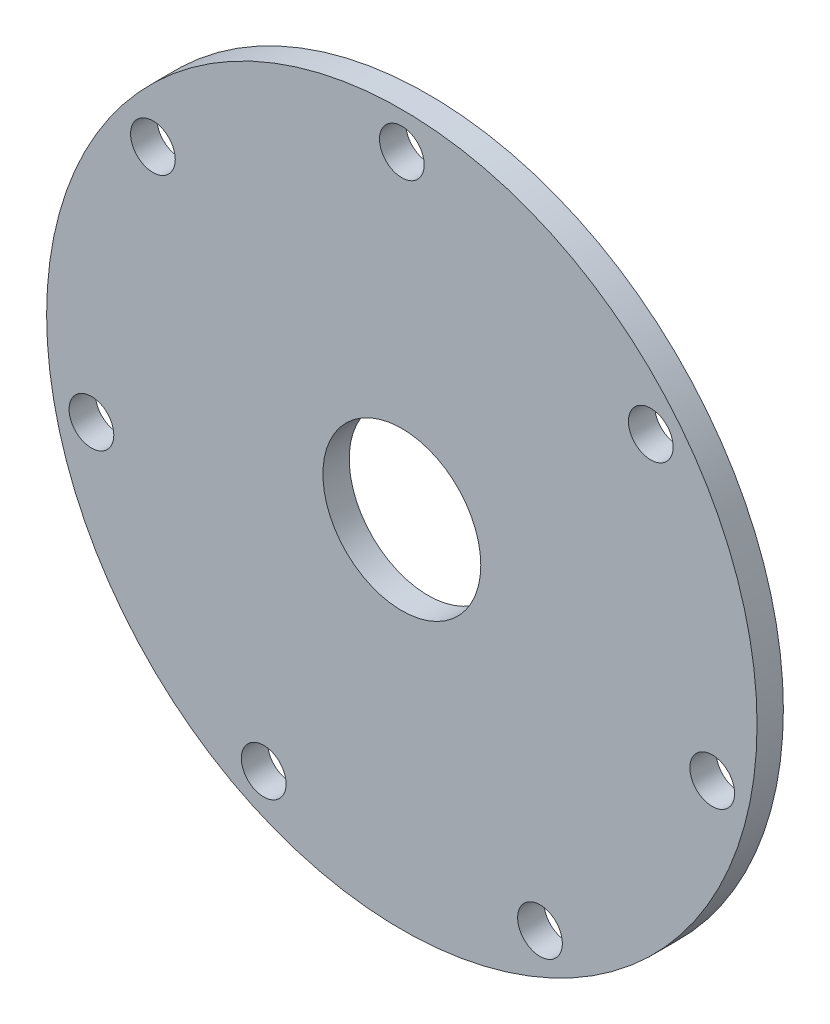
ISO-10303-21;
HEADER;
FILE_DESCRIPTION(('STEP AP214'),'2;1');
FILE_NAME('part.step','',(''),(''),'','','');
FILE_SCHEMA(('AUTOMOTIVE_DESIGN { 1 0 10303 214 1 1 1 1 }'));
ENDSEC;
DATA;
#1=APPLICATION_CONTEXT('core data for automotive mechanical design processes');
#2=APPLICATION_PROTOCOL_DEFINITION('international standard','automotive_design',2000,#1);
#3=PRODUCT_CONTEXT('',#1,'mechanical');
#4=PRODUCT('Part','Part','',(#3));
#5=PRODUCT_RELATED_PRODUCT_CATEGORY('part','',(#4));
#6=PRODUCT_DEFINITION_FORMATION('','',#4);
#7=PRODUCT_DEFINITION_CONTEXT('part definition',#1,'design');
#8=PRODUCT_DEFINITION('design','',#6,#7);
#9=PRODUCT_DEFINITION_SHAPE('','',#8);
#10=(LENGTH_UNIT() NAMED_UNIT(*) SI_UNIT(.MILLI.,.METRE.));
#11=(NAMED_UNIT(*) PLANE_ANGLE_UNIT() SI_UNIT($,.RADIAN.));
#12=(NAMED_UNIT(*) SI_UNIT($,.STERADIAN.) SOLID_ANGLE_UNIT());
#13=UNCERTAINTY_MEASURE_WITH_UNIT(LENGTH_MEASURE(1.E-05),#10,'distance_accuracy_value','');
#14=(GEOMETRIC_REPRESENTATION_CONTEXT(3) GLOBAL_UNCERTAINTY_ASSIGNED_CONTEXT((#13)) GLOBAL_UNIT_ASSIGNED_CONTEXT((#10,
#11,#12)) REPRESENTATION_CONTEXT('',''));
#15=CARTESIAN_POINT('',(0.,0.,0.));
#16=DIRECTION('',(0.,0.,1.));
#17=DIRECTION('',(1.,0.,0.));
#18=AXIS2_PLACEMENT_3D('',#15,#16,#17);
#19=CARTESIAN_POINT('',(0.,0.,5.));
#20=DIRECTION('',(0.,0.,1.));
#21=DIRECTION('',(1.,0.,0.));
#22=AXIS2_PLACEMENT_3D('',#19,#20,#21);
#23=PLANE('',#22);
#24=CARTESIAN_POINT('',(-47.3008046893158,37.7211330124534,5.));
#25=DIRECTION('',(0.,0.,1.));
#26=DIRECTION('',(1.,0.,0.));
#27=AXIS2_PLACEMENT_3D('',#24,#25,#26);
#28=CIRCLE('',#27,4.25);
#29=CARTESIAN_POINT('',(-43.0508046893158,37.7211330124534,5.));
#30=VERTEX_POINT('',#29);
#31=EDGE_CURVE('E77',#30,#30,#28,.T.);
#32=ORIENTED_EDGE('',*,*,#31,.F.);
#33=EDGE_LOOP('',(#32));
#34=FACE_BOUND('',#33,.T.);
#35=CARTESIAN_POINT('',(-26.2499662166123,-54.5086165080964,5.));
#36=DIRECTION('',(0.,0.,1.));
#37=DIRECTION('',(1.,0.,0.));
#38=AXIS2_PLACEMENT_3D('',#35,#36,#37);
#39=CIRCLE('',#38,4.25000000000001);
#40=CARTESIAN_POINT('',(-21.9999662166122,-54.5086165080964,5.));
#41=VERTEX_POINT('',#40);
#42=EDGE_CURVE('E65',#41,#41,#39,.T.);
#43=ORIENTED_EDGE('',*,*,#42,.F.);
#44=EDGE_LOOP('',(#43));
#45=FACE_BOUND('',#44,.T.);
#46=CARTESIAN_POINT('',(58.9831386870003,-13.462516504357,5.));
#47=DIRECTION('',(0.,0.,1.));
#48=DIRECTION('',(1.,0.,0.));
#49=AXIS2_PLACEMENT_3D('',#46,#47,#48);
#50=CIRCLE('',#49,4.25000000000001);
#51=CARTESIAN_POINT('',(63.2331386870003,-13.462516504357,5.));
#52=VERTEX_POINT('',#51);
#53=EDGE_CURVE('E53',#52,#52,#50,.T.);
#54=ORIENTED_EDGE('',*,*,#53,.F.);
#55=EDGE_LOOP('',(#54));
#56=FACE_BOUND('',#55,.T.);
#57=CARTESIAN_POINT('',(0.,60.5,5.));
#58=DIRECTION('',(0.,0.,1.));
#59=DIRECTION('',(1.,0.,0.));
#60=AXIS2_PLACEMENT_3D('',#57,#58,#59);
#61=CIRCLE('',#60,4.25);
#62=CARTESIAN_POINT('',(4.25,60.5,5.));
#63=VERTEX_POINT('',#62);
#64=EDGE_CURVE('E42',#63,#63,#61,.T.);
#65=ORIENTED_EDGE('',*,*,#64,.F.);
#66=EDGE_LOOP('',(#65));
#67=FACE_BOUND('',#66,.T.);
#68=CARTESIAN_POINT('',(0.,0.,5.));
#69=DIRECTION('',(0.,0.,1.));
#70=DIRECTION('',(1.,0.,0.));
#71=AXIS2_PLACEMENT_3D('',#68,#69,#70);
#72=CIRCLE('',#71,67.5);
#73=CARTESIAN_POINT('',(67.5,0.,5.));
#74=VERTEX_POINT('',#73);
#75=EDGE_CURVE('E10',#74,#74,#72,.T.);
#76=ORIENTED_EDGE('',*,*,#75,.T.);
#77=EDGE_LOOP('',(#76));
#78=FACE_BOUND('',#77,.T.);
#79=CARTESIAN_POINT('',(47.3008046893158,37.7211330124534,5.));
#80=DIRECTION('',(0.,0.,1.));
#81=DIRECTION('',(1.,0.,0.));
#82=AXIS2_PLACEMENT_3D('',#79,#80,#81);
#83=CIRCLE('',#82,4.25);
#84=CARTESIAN_POINT('',(51.5508046893158,37.7211330124534,5.));
#85=VERTEX_POINT('',#84);
#86=EDGE_CURVE('E47',#85,#85,#83,.T.);
#87=ORIENTED_EDGE('',*,*,#86,.F.);
#88=EDGE_LOOP('',(#87));
#89=FACE_BOUND('',#88,.T.);
#90=CARTESIAN_POINT('',(26.2499662166123,-54.5086165080964,5.));
#91=DIRECTION('',(0.,0.,1.));
#92=DIRECTION('',(1.,0.,0.));
#93=AXIS2_PLACEMENT_3D('',#90,#91,#92);
#94=CIRCLE('',#93,4.25000000000001);
#95=CARTESIAN_POINT('',(30.4999662166123,-54.5086165080964,5.));
#96=VERTEX_POINT('',#95);
#97=EDGE_CURVE('E59',#96,#96,#94,.T.);
#98=ORIENTED_EDGE('',*,*,#97,.F.);
#99=EDGE_LOOP('',(#98));
#100=FACE_BOUND('',#99,.T.);
#101=CARTESIAN_POINT('',(-58.9831386870003,-13.462516504357,5.));
#102=DIRECTION('',(0.,0.,1.));
#103=DIRECTION('',(1.,0.,0.));
#104=AXIS2_PLACEMENT_3D('',#101,#102,#103);
#105=CIRCLE('',#104,4.25000000000001);
#106=CARTESIAN_POINT('',(-54.7331386870003,-13.462516504357,5.));
#107=VERTEX_POINT('',#106);
#108=EDGE_CURVE('E71',#107,#107,#105,.T.);
#109=ORIENTED_EDGE('',*,*,#108,.F.);
#110=EDGE_LOOP('',(#109));
#111=FACE_BOUND('',#110,.T.);
#112=CARTESIAN_POINT('',(0.,0.,5.));
#113=DIRECTION('',(0.,0.,1.));
#114=DIRECTION('',(1.,0.,0.));
#115=AXIS2_PLACEMENT_3D('',#112,#113,#114);
#116=CIRCLE('',#115,15.);
#117=CARTESIAN_POINT('',(15.,0.,5.));
#118=VERTEX_POINT('',#117);
#119=EDGE_CURVE('E83',#118,#118,#116,.T.);
#120=ORIENTED_EDGE('',*,*,#119,.F.);
#121=EDGE_LOOP('',(#120));
#122=FACE_BOUND('',#121,.T.);
#123=ADVANCED_FACE('F31',(#34,#45,#56,#67,#78,#89,#100,#111,#122),#23,.T.);
#124=CARTESIAN_POINT('',(0.,0.,0.));
#125=DIRECTION('',(0.,0.,1.));
#126=DIRECTION('',(1.,0.,0.));
#127=AXIS2_PLACEMENT_3D('',#124,#125,#126);
#128=PLANE('',#127);
#129=CARTESIAN_POINT('',(0.,0.,0.));
#130=DIRECTION('',(0.,0.,1.));
#131=DIRECTION('',(1.,0.,0.));
#132=AXIS2_PLACEMENT_3D('',#129,#130,#131);
#133=CIRCLE('',#132,67.5);
#134=CARTESIAN_POINT('',(67.5,0.,0.));
#135=VERTEX_POINT('',#134);
#136=EDGE_CURVE('E35',#135,#135,#133,.T.);
#137=ORIENTED_EDGE('',*,*,#136,.F.);
#138=EDGE_LOOP('',(#137));
#139=FACE_BOUND('',#138,.T.);
#140=CARTESIAN_POINT('',(0.,60.5,0.));
#141=DIRECTION('',(0.,0.,1.));
#142=DIRECTION('',(1.,0.,0.));
#143=AXIS2_PLACEMENT_3D('',#140,#141,#142);
#144=CIRCLE('',#143,4.25);
#145=CARTESIAN_POINT('',(4.25,60.5,0.));
#146=VERTEX_POINT('',#145);
#147=EDGE_CURVE('E44',#146,#146,#144,.T.);
#148=ORIENTED_EDGE('',*,*,#147,.T.);
#149=EDGE_LOOP('',(#148));
#150=FACE_BOUND('',#149,.T.);
#151=CARTESIAN_POINT('',(47.3008046893158,37.7211330124534,0.));
#152=DIRECTION('',(0.,0.,1.));
#153=DIRECTION('',(1.,0.,0.));
#154=AXIS2_PLACEMENT_3D('',#151,#152,#153);
#155=CIRCLE('',#154,4.25);
#156=CARTESIAN_POINT('',(51.5508046893158,37.7211330124534,0.));
#157=VERTEX_POINT('',#156);
#158=EDGE_CURVE('E50',#157,#157,#155,.T.);
#159=ORIENTED_EDGE('',*,*,#158,.T.);
#160=EDGE_LOOP('',(#159));
#161=FACE_BOUND('',#160,.T.);
#162=CARTESIAN_POINT('',(58.9831386870003,-13.462516504357,0.));
#163=DIRECTION('',(0.,0.,1.));
#164=DIRECTION('',(1.,0.,0.));
#165=AXIS2_PLACEMENT_3D('',#162,#163,#164);
#166=CIRCLE('',#165,4.25000000000001);
#167=CARTESIAN_POINT('',(63.2331386870003,-13.462516504357,0.));
#168=VERTEX_POINT('',#167);
#169=EDGE_CURVE('E56',#168,#168,#166,.T.);
#170=ORIENTED_EDGE('',*,*,#169,.T.);
#171=EDGE_LOOP('',(#170));
#172=FACE_BOUND('',#171,.T.);
#173=CARTESIAN_POINT('',(26.2499662166123,-54.5086165080964,0.));
#174=DIRECTION('',(0.,0.,1.));
#175=DIRECTION('',(1.,0.,0.));
#176=AXIS2_PLACEMENT_3D('',#173,#174,#175);
#177=CIRCLE('',#176,4.25000000000001);
#178=CARTESIAN_POINT('',(30.4999662166123,-54.5086165080964,0.));
#179=VERTEX_POINT('',#178);
#180=EDGE_CURVE('E62',#179,#179,#177,.T.);
#181=ORIENTED_EDGE('',*,*,#180,.T.);
#182=EDGE_LOOP('',(#181));
#183=FACE_BOUND('',#182,.T.);
#184=CARTESIAN_POINT('',(-26.2499662166123,-54.5086165080964,0.));
#185=DIRECTION('',(0.,0.,1.));
#186=DIRECTION('',(1.,0.,0.));
#187=AXIS2_PLACEMENT_3D('',#184,#185,#186);
#188=CIRCLE('',#187,4.25000000000001);
#189=CARTESIAN_POINT('',(-21.9999662166122,-54.5086165080964,0.));
#190=VERTEX_POINT('',#189);
#191=EDGE_CURVE('E68',#190,#190,#188,.T.);
#192=ORIENTED_EDGE('',*,*,#191,.T.);
#193=EDGE_LOOP('',(#192));
#194=FACE_BOUND('',#193,.T.);
#195=CARTESIAN_POINT('',(-58.9831386870003,-13.462516504357,0.));
#196=DIRECTION('',(0.,0.,1.));
#197=DIRECTION('',(1.,0.,0.));
#198=AXIS2_PLACEMENT_3D('',#195,#196,#197);
#199=CIRCLE('',#198,4.25000000000001);
#200=CARTESIAN_POINT('',(-54.7331386870003,-13.462516504357,0.));
#201=VERTEX_POINT('',#200);
#202=EDGE_CURVE('E74',#201,#201,#199,.T.);
#203=ORIENTED_EDGE('',*,*,#202,.T.);
#204=EDGE_LOOP('',(#203));
#205=FACE_BOUND('',#204,.T.);
#206=CARTESIAN_POINT('',(-47.3008046893158,37.7211330124534,0.));
#207=DIRECTION('',(0.,0.,1.));
#208=DIRECTION('',(1.,0.,0.));
#209=AXIS2_PLACEMENT_3D('',#206,#207,#208);
#210=CIRCLE('',#209,4.25);
#211=CARTESIAN_POINT('',(-43.0508046893158,37.7211330124534,0.));
#212=VERTEX_POINT('',#211);
#213=EDGE_CURVE('E80',#212,#212,#210,.T.);
#214=ORIENTED_EDGE('',*,*,#213,.T.);
#215=EDGE_LOOP('',(#214));
#216=FACE_BOUND('',#215,.T.);
#217=CARTESIAN_POINT('',(0.,0.,0.));
#218=DIRECTION('',(0.,0.,1.));
#219=DIRECTION('',(1.,0.,0.));
#220=AXIS2_PLACEMENT_3D('',#217,#218,#219);
#221=CIRCLE('',#220,15.);
#222=CARTESIAN_POINT('',(15.,0.,0.));
#223=VERTEX_POINT('',#222);
#224=EDGE_CURVE('E86',#223,#223,#221,.T.);
#225=ORIENTED_EDGE('',*,*,#224,.T.);
#226=EDGE_LOOP('',(#225));
#227=FACE_BOUND('',#226,.T.);
#228=ADVANCED_FACE('F96',(#139,#150,#161,#172,#183,#194,#205,#216,#227),#128,.F.);
#229=CARTESIAN_POINT('',(0.,0.,5.));
#230=DIRECTION('',(0.,0.,-1.));
#231=DIRECTION('',(-1.,0.,0.));
#232=AXIS2_PLACEMENT_3D('',#229,#230,#231);
#233=CYLINDRICAL_SURFACE('',#232,67.5);
#234=ORIENTED_EDGE('',*,*,#75,.F.);
#235=EDGE_LOOP('',(#234));
#236=FACE_BOUND('',#235,.T.);
#237=ORIENTED_EDGE('',*,*,#136,.T.);
#238=EDGE_LOOP('',(#237));
#239=FACE_BOUND('',#238,.T.);
#240=ADVANCED_FACE('F33',(#236,#239),#233,.T.);
#241=CARTESIAN_POINT('',(0.,60.5,5.));
#242=DIRECTION('',(0.,0.,-1.));
#243=DIRECTION('',(-1.,0.,0.));
#244=AXIS2_PLACEMENT_3D('',#241,#242,#243);
#245=CYLINDRICAL_SURFACE('',#244,4.25);
#246=ORIENTED_EDGE('',*,*,#64,.T.);
#247=EDGE_LOOP('',(#246));
#248=FACE_BOUND('',#247,.T.);
#249=ORIENTED_EDGE('',*,*,#147,.F.);
#250=EDGE_LOOP('',(#249));
#251=FACE_BOUND('',#250,.T.);
#252=ADVANCED_FACE('F106',(#248,#251),#245,.F.);
#253=CARTESIAN_POINT('',(47.3008046893158,37.7211330124534,5.));
#254=DIRECTION('',(0.,0.,-1.));
#255=DIRECTION('',(-1.,0.,0.));
#256=AXIS2_PLACEMENT_3D('',#253,#254,#255);
#257=CYLINDRICAL_SURFACE('',#256,4.25);
#258=ORIENTED_EDGE('',*,*,#86,.T.);
#259=EDGE_LOOP('',(#258));
#260=FACE_BOUND('',#259,.T.);
#261=ORIENTED_EDGE('',*,*,#158,.F.);
#262=EDGE_LOOP('',(#261));
#263=FACE_BOUND('',#262,.T.);
#264=ADVANCED_FACE('F109',(#260,#263),#257,.F.);
#265=CARTESIAN_POINT('',(58.9831386870003,-13.462516504357,5.));
#266=DIRECTION('',(0.,0.,-1.));
#267=DIRECTION('',(-1.,0.,0.));
#268=AXIS2_PLACEMENT_3D('',#265,#266,#267);
#269=CYLINDRICAL_SURFACE('',#268,4.25000000000001);
#270=ORIENTED_EDGE('',*,*,#53,.T.);
#271=EDGE_LOOP('',(#270));
#272=FACE_BOUND('',#271,.T.);
#273=ORIENTED_EDGE('',*,*,#169,.F.);
#274=EDGE_LOOP('',(#273));
#275=FACE_BOUND('',#274,.T.);
#276=ADVANCED_FACE('F113',(#272,#275),#269,.F.);
#277=CARTESIAN_POINT('',(26.2499662166123,-54.5086165080964,5.));
#278=DIRECTION('',(0.,0.,-1.));
#279=DIRECTION('',(-1.,0.,0.));
#280=AXIS2_PLACEMENT_3D('',#277,#278,#279);
#281=CYLINDRICAL_SURFACE('',#280,4.25000000000001);
#282=ORIENTED_EDGE('',*,*,#97,.T.);
#283=EDGE_LOOP('',(#282));
#284=FACE_BOUND('',#283,.T.);
#285=ORIENTED_EDGE('',*,*,#180,.F.);
#286=EDGE_LOOP('',(#285));
#287=FACE_BOUND('',#286,.T.);
#288=ADVANCED_FACE('F117',(#284,#287),#281,.F.);
#289=CARTESIAN_POINT('',(-26.2499662166123,-54.5086165080964,5.));
#290=DIRECTION('',(0.,0.,-1.));
#291=DIRECTION('',(-1.,0.,0.));
#292=AXIS2_PLACEMENT_3D('',#289,#290,#291);
#293=CYLINDRICAL_SURFACE('',#292,4.25000000000001);
#294=ORIENTED_EDGE('',*,*,#42,.T.);
#295=EDGE_LOOP('',(#294));
#296=FACE_BOUND('',#295,.T.);
#297=ORIENTED_EDGE('',*,*,#191,.F.);
#298=EDGE_LOOP('',(#297));
#299=FACE_BOUND('',#298,.T.);
#300=ADVANCED_FACE('F121',(#296,#299),#293,.F.);
#301=CARTESIAN_POINT('',(-58.9831386870003,-13.462516504357,5.));
#302=DIRECTION('',(0.,0.,-1.));
#303=DIRECTION('',(-1.,0.,0.));
#304=AXIS2_PLACEMENT_3D('',#301,#302,#303);
#305=CYLINDRICAL_SURFACE('',#304,4.25000000000001);
#306=ORIENTED_EDGE('',*,*,#108,.T.);
#307=EDGE_LOOP('',(#306));
#308=FACE_BOUND('',#307,.T.);
#309=ORIENTED_EDGE('',*,*,#202,.F.);
#310=EDGE_LOOP('',(#309));
#311=FACE_BOUND('',#310,.T.);
#312=ADVANCED_FACE('F125',(#308,#311),#305,.F.);
#313=CARTESIAN_POINT('',(-47.3008046893158,37.7211330124534,5.));
#314=DIRECTION('',(0.,0.,-1.));
#315=DIRECTION('',(-1.,0.,0.));
#316=AXIS2_PLACEMENT_3D('',#313,#314,#315);
#317=CYLINDRICAL_SURFACE('',#316,4.25);
#318=ORIENTED_EDGE('',*,*,#31,.T.);
#319=EDGE_LOOP('',(#318));
#320=FACE_BOUND('',#319,.T.);
#321=ORIENTED_EDGE('',*,*,#213,.F.);
#322=EDGE_LOOP('',(#321));
#323=FACE_BOUND('',#322,.T.);
#324=ADVANCED_FACE('F129',(#320,#323),#317,.F.);
#325=CARTESIAN_POINT('',(0.,0.,5.));
#326=DIRECTION('',(0.,0.,-1.));
#327=DIRECTION('',(-1.,0.,0.));
#328=AXIS2_PLACEMENT_3D('',#325,#326,#327);
#329=CYLINDRICAL_SURFACE('',#328,15.);
#330=ORIENTED_EDGE('',*,*,#119,.T.);
#331=EDGE_LOOP('',(#330));
#332=FACE_BOUND('',#331,.T.);
#333=ORIENTED_EDGE('',*,*,#224,.F.);
#334=EDGE_LOOP('',(#333));
#335=FACE_BOUND('',#334,.T.);
#336=ADVANCED_FACE('F92',(#332,#335),#329,.F.);
#337=CLOSED_SHELL('',(#123,#228,#240,#252,#264,#276,#288,#300,#312,#324,#336));
#338=MANIFOLD_SOLID_BREP('B2',#337);
#339=ADVANCED_BREP_SHAPE_REPRESENTATION('',(#18,#338),#14);
#340=SHAPE_DEFINITION_REPRESENTATION(#9,#339);
ENDSEC;
END-ISO-10303-21;
